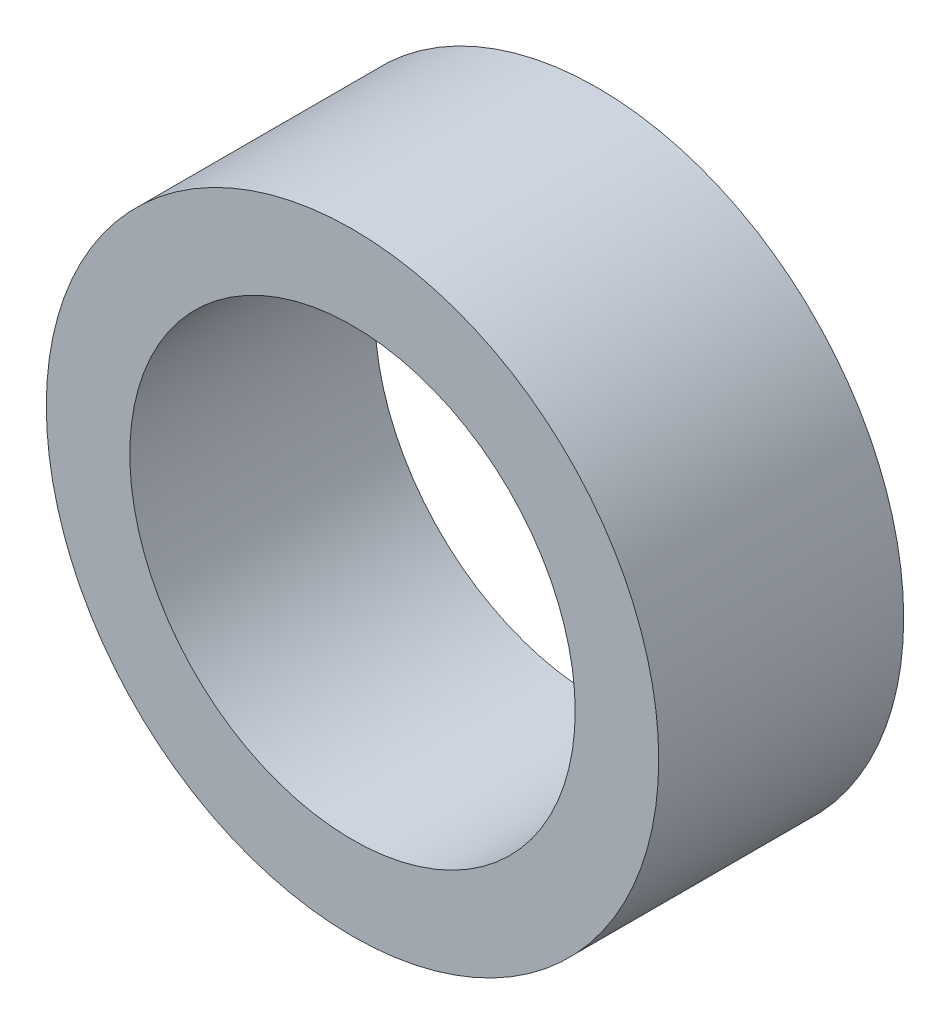
ISO-10303-21;
HEADER;
FILE_DESCRIPTION(('STEP AP214'),'2;1');
FILE_NAME('part.step','',(''),(''),'','','');
FILE_SCHEMA(('AUTOMOTIVE_DESIGN { 1 0 10303 214 1 1 1 1 }'));
ENDSEC;
DATA;
#1=APPLICATION_CONTEXT('core data for automotive mechanical design processes');
#2=APPLICATION_PROTOCOL_DEFINITION('international standard','automotive_design',2000,#1);
#3=PRODUCT_CONTEXT('',#1,'mechanical');
#4=PRODUCT('Part','Part','',(#3));
#5=PRODUCT_RELATED_PRODUCT_CATEGORY('part','',(#4));
#6=PRODUCT_DEFINITION_FORMATION('','',#4);
#7=PRODUCT_DEFINITION_CONTEXT('part definition',#1,'design');
#8=PRODUCT_DEFINITION('design','',#6,#7);
#9=PRODUCT_DEFINITION_SHAPE('','',#8);
#10=(LENGTH_UNIT() NAMED_UNIT(*) SI_UNIT(.MILLI.,.METRE.));
#11=(NAMED_UNIT(*) PLANE_ANGLE_UNIT() SI_UNIT($,.RADIAN.));
#12=(NAMED_UNIT(*) SI_UNIT($,.STERADIAN.) SOLID_ANGLE_UNIT());
#13=UNCERTAINTY_MEASURE_WITH_UNIT(LENGTH_MEASURE(1.E-05),#10,'distance_accuracy_value','');
#14=(GEOMETRIC_REPRESENTATION_CONTEXT(3) GLOBAL_UNCERTAINTY_ASSIGNED_CONTEXT((#13)) GLOBAL_UNIT_ASSIGNED_CONTEXT((#10,
#11,#12)) REPRESENTATION_CONTEXT('',''));
#15=CARTESIAN_POINT('',(0.,0.,0.));
#16=DIRECTION('',(0.,0.,1.));
#17=DIRECTION('',(1.,0.,0.));
#18=AXIS2_PLACEMENT_3D('',#15,#16,#17);
#19=CARTESIAN_POINT('',(0.,0.,8.8));
#20=DIRECTION('',(0.,0.,1.));
#21=DIRECTION('',(1.,0.,0.));
#22=AXIS2_PLACEMENT_3D('',#19,#20,#21);
#23=PLANE('',#22);
#24=CARTESIAN_POINT('',(0.,0.,8.8));
#25=DIRECTION('',(0.,0.,1.));
#26=DIRECTION('',(1.,0.,0.));
#27=AXIS2_PLACEMENT_3D('',#24,#25,#26);
#28=CIRCLE('',#27,11.);
#29=CARTESIAN_POINT('',(11.,0.,8.8));
#30=VERTEX_POINT('',#29);
#31=EDGE_CURVE('E10',#30,#30,#28,.T.);
#32=ORIENTED_EDGE('',*,*,#31,.T.);
#33=EDGE_LOOP('',(#32));
#34=FACE_BOUND('',#33,.T.);
#35=CARTESIAN_POINT('',(0.,0.,8.8));
#36=DIRECTION('',(0.,0.,1.));
#37=DIRECTION('',(1.,0.,0.));
#38=AXIS2_PLACEMENT_3D('',#35,#36,#37);
#39=CIRCLE('',#38,8.);
#40=CARTESIAN_POINT('',(8.,0.,8.8));
#41=VERTEX_POINT('',#40);
#42=EDGE_CURVE('E42',#41,#41,#39,.T.);
#43=ORIENTED_EDGE('',*,*,#42,.F.);
#44=EDGE_LOOP('',(#43));
#45=FACE_BOUND('',#44,.T.);
#46=ADVANCED_FACE('F31',(#34,#45),#23,.T.);
#47=CARTESIAN_POINT('',(0.,0.,0.));
#48=DIRECTION('',(0.,0.,1.));
#49=DIRECTION('',(1.,0.,0.));
#50=AXIS2_PLACEMENT_3D('',#47,#48,#49);
#51=PLANE('',#50);
#52=CARTESIAN_POINT('',(0.,0.,0.));
#53=DIRECTION('',(0.,0.,1.));
#54=DIRECTION('',(1.,0.,0.));
#55=AXIS2_PLACEMENT_3D('',#52,#53,#54);
#56=CIRCLE('',#55,11.);
#57=CARTESIAN_POINT('',(11.,0.,0.));
#58=VERTEX_POINT('',#57);
#59=EDGE_CURVE('E35',#58,#58,#56,.T.);
#60=ORIENTED_EDGE('',*,*,#59,.F.);
#61=EDGE_LOOP('',(#60));
#62=FACE_BOUND('',#61,.T.);
#63=CARTESIAN_POINT('',(0.,0.,0.));
#64=DIRECTION('',(0.,0.,1.));
#65=DIRECTION('',(1.,0.,0.));
#66=AXIS2_PLACEMENT_3D('',#63,#64,#65);
#67=CIRCLE('',#66,8.);
#68=CARTESIAN_POINT('',(8.,0.,0.));
#69=VERTEX_POINT('',#68);
#70=EDGE_CURVE('E44',#69,#69,#67,.T.);
#71=ORIENTED_EDGE('',*,*,#70,.T.);
#72=EDGE_LOOP('',(#71));
#73=FACE_BOUND('',#72,.T.);
#74=ADVANCED_FACE('F54',(#62,#73),#51,.F.);
#75=CARTESIAN_POINT('',(0.,0.,8.8));
#76=DIRECTION('',(0.,0.,-1.));
#77=DIRECTION('',(-1.,0.,0.));
#78=AXIS2_PLACEMENT_3D('',#75,#76,#77);
#79=CYLINDRICAL_SURFACE('',#78,11.);
#80=ORIENTED_EDGE('',*,*,#31,.F.);
#81=EDGE_LOOP('',(#80));
#82=FACE_BOUND('',#81,.T.);
#83=ORIENTED_EDGE('',*,*,#59,.T.);
#84=EDGE_LOOP('',(#83));
#85=FACE_BOUND('',#84,.T.);
#86=ADVANCED_FACE('F33',(#82,#85),#79,.T.);
#87=CARTESIAN_POINT('',(0.,0.,8.8));
#88=DIRECTION('',(0.,0.,-1.));
#89=DIRECTION('',(-1.,0.,0.));
#90=AXIS2_PLACEMENT_3D('',#87,#88,#89);
#91=CYLINDRICAL_SURFACE('',#90,8.);
#92=ORIENTED_EDGE('',*,*,#42,.T.);
#93=EDGE_LOOP('',(#92));
#94=FACE_BOUND('',#93,.T.);
#95=ORIENTED_EDGE('',*,*,#70,.F.);
#96=EDGE_LOOP('',(#95));
#97=FACE_BOUND('',#96,.T.);
#98=ADVANCED_FACE('F50',(#94,#97),#91,.F.);
#99=CLOSED_SHELL('',(#46,#74,#86,#98));
#100=MANIFOLD_SOLID_BREP('B2',#99);
#101=ADVANCED_BREP_SHAPE_REPRESENTATION('',(#18,#100),#14);
#102=SHAPE_DEFINITION_REPRESENTATION(#9,#101);
ENDSEC;
END-ISO-10303-21;
